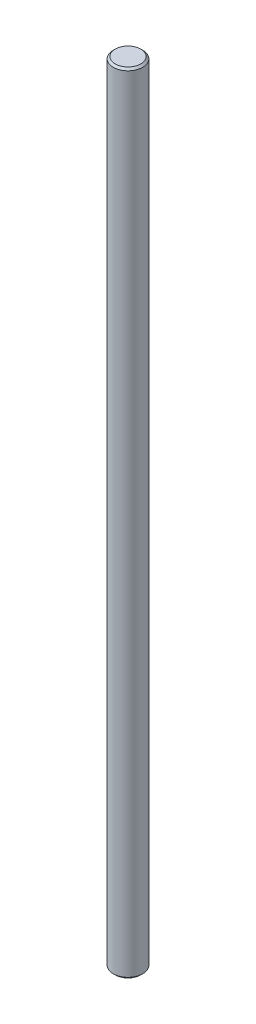
ISO-10303-21;
HEADER;
FILE_DESCRIPTION(('STEP AP214'),'2;1');
FILE_NAME('part.step','',(''),(''),'','','');
FILE_SCHEMA(('AUTOMOTIVE_DESIGN { 1 0 10303 214 1 1 1 1 }'));
ENDSEC;
DATA;
#1=APPLICATION_CONTEXT('core data for automotive mechanical design processes');
#2=APPLICATION_PROTOCOL_DEFINITION('international standard','automotive_design',2000,#1);
#3=PRODUCT_CONTEXT('',#1,'mechanical');
#4=PRODUCT('Part','Part','',(#3));
#5=PRODUCT_RELATED_PRODUCT_CATEGORY('part','',(#4));
#6=PRODUCT_DEFINITION_FORMATION('','',#4);
#7=PRODUCT_DEFINITION_CONTEXT('part definition',#1,'design');
#8=PRODUCT_DEFINITION('design','',#6,#7);
#9=PRODUCT_DEFINITION_SHAPE('','',#8);
#10=(LENGTH_UNIT() NAMED_UNIT(*) SI_UNIT(.MILLI.,.METRE.));
#11=(NAMED_UNIT(*) PLANE_ANGLE_UNIT() SI_UNIT($,.RADIAN.));
#12=(NAMED_UNIT(*) SI_UNIT($,.STERADIAN.) SOLID_ANGLE_UNIT());
#13=UNCERTAINTY_MEASURE_WITH_UNIT(LENGTH_MEASURE(1.E-05),#10,'distance_accuracy_value','');
#14=(GEOMETRIC_REPRESENTATION_CONTEXT(3) GLOBAL_UNCERTAINTY_ASSIGNED_CONTEXT((#13)) GLOBAL_UNIT_ASSIGNED_CONTEXT((#10,
#11,#12)) REPRESENTATION_CONTEXT('',''));
#15=CARTESIAN_POINT('',(0.,0.,0.));
#16=DIRECTION('',(0.,0.,1.));
#17=DIRECTION('',(1.,0.,0.));
#18=AXIS2_PLACEMENT_3D('',#15,#16,#17);
#19=CARTESIAN_POINT('',(0.,254.,0.));
#20=DIRECTION('',(0.,-1.,0.));
#21=DIRECTION('',(0.,0.,-1.));
#22=AXIS2_PLACEMENT_3D('',#19,#20,#21);
#23=CYLINDRICAL_SURFACE('',#22,4.7625);
#24=CARTESIAN_POINT('',(0.,253.365,0.));
#25=DIRECTION('',(0.,1.,0.));
#26=DIRECTION('',(0.,0.,1.));
#27=AXIS2_PLACEMENT_3D('',#24,#25,#26);
#28=CIRCLE('',#27,4.7625);
#29=CARTESIAN_POINT('',(0.,253.365,4.7625));
#30=VERTEX_POINT('',#29);
#31=EDGE_CURVE('E36',#30,#30,#28,.F.);
#32=ORIENTED_EDGE('',*,*,#31,.T.);
#33=EDGE_LOOP('',(#32));
#34=FACE_BOUND('',#33,.T.);
#35=CARTESIAN_POINT('',(0.,0.634999999999997,0.));
#36=DIRECTION('',(0.,1.,0.));
#37=DIRECTION('',(0.,0.,1.));
#38=AXIS2_PLACEMENT_3D('',#35,#36,#37);
#39=CIRCLE('',#38,4.7625);
#40=CARTESIAN_POINT('',(0.,0.634999999999997,4.7625));
#41=VERTEX_POINT('',#40);
#42=EDGE_CURVE('E40',#41,#41,#39,.T.);
#43=ORIENTED_EDGE('',*,*,#42,.T.);
#44=EDGE_LOOP('',(#43));
#45=FACE_BOUND('',#44,.T.);
#46=ADVANCED_FACE('F29',(#34,#45),#23,.T.);
#47=CARTESIAN_POINT('',(0.,254.,0.));
#48=DIRECTION('',(0.,1.,0.));
#49=DIRECTION('',(0.,0.,1.));
#50=AXIS2_PLACEMENT_3D('',#47,#48,#49);
#51=PLANE('',#50);
#52=CARTESIAN_POINT('',(0.,254.,0.));
#53=DIRECTION('',(0.,1.,0.));
#54=DIRECTION('',(0.,0.,1.));
#55=AXIS2_PLACEMENT_3D('',#52,#53,#54);
#56=CIRCLE('',#55,4.12750000000001);
#57=CARTESIAN_POINT('',(0.,254.,4.12750000000001));
#58=VERTEX_POINT('',#57);
#59=EDGE_CURVE('E44',#58,#58,#56,.T.);
#60=ORIENTED_EDGE('',*,*,#59,.T.);
#61=EDGE_LOOP('',(#60));
#62=FACE_BOUND('',#61,.T.);
#63=ADVANCED_FACE('F50',(#62),#51,.T.);
#64=CARTESIAN_POINT('',(0.,0.,0.));
#65=DIRECTION('',(0.,1.,0.));
#66=DIRECTION('',(0.,0.,1.));
#67=AXIS2_PLACEMENT_3D('',#64,#65,#66);
#68=PLANE('',#67);
#69=CARTESIAN_POINT('',(0.,0.,0.));
#70=DIRECTION('',(0.,1.,0.));
#71=DIRECTION('',(0.,0.,1.));
#72=AXIS2_PLACEMENT_3D('',#69,#70,#71);
#73=CIRCLE('',#72,4.12750000000003);
#74=CARTESIAN_POINT('',(0.,0.,4.12750000000003));
#75=VERTEX_POINT('',#74);
#76=EDGE_CURVE('E10',#75,#75,#73,.F.);
#77=ORIENTED_EDGE('',*,*,#76,.T.);
#78=EDGE_LOOP('',(#77));
#79=FACE_BOUND('',#78,.T.);
#80=ADVANCED_FACE('F54',(#79),#68,.F.);
#81=CARTESIAN_POINT('',(0.,254.,0.));
#82=DIRECTION('',(0.,-1.,0.));
#83=DIRECTION('',(0.,0.,-1.));
#84=AXIS2_PLACEMENT_3D('',#81,#82,#83);
#85=CONICAL_SURFACE('',#84,4.12750000000001,0.78539816339749);
#86=ORIENTED_EDGE('',*,*,#31,.F.);
#87=EDGE_LOOP('',(#86));
#88=FACE_BOUND('',#87,.T.);
#89=ORIENTED_EDGE('',*,*,#59,.F.);
#90=EDGE_LOOP('',(#89));
#91=FACE_BOUND('',#90,.T.);
#92=ADVANCED_FACE('F52',(#88,#91),#85,.T.);
#93=CARTESIAN_POINT('',(0.,0.634999999999997,0.));
#94=DIRECTION('',(0.,1.,0.));
#95=DIRECTION('',(0.,0.,1.));
#96=AXIS2_PLACEMENT_3D('',#93,#94,#95);
#97=CONICAL_SURFACE('',#96,4.7625,0.785398163397424);
#98=ORIENTED_EDGE('',*,*,#76,.F.);
#99=EDGE_LOOP('',(#98));
#100=FACE_BOUND('',#99,.T.);
#101=ORIENTED_EDGE('',*,*,#42,.F.);
#102=EDGE_LOOP('',(#101));
#103=FACE_BOUND('',#102,.T.);
#104=ADVANCED_FACE('F31',(#100,#103),#97,.T.);
#105=CLOSED_SHELL('',(#46,#63,#80,#92,#104));
#106=MANIFOLD_SOLID_BREP('B2',#105);
#107=ADVANCED_BREP_SHAPE_REPRESENTATION('',(#18,#106),#14);
#108=SHAPE_DEFINITION_REPRESENTATION(#9,#107);
ENDSEC;
END-ISO-10303-21;
